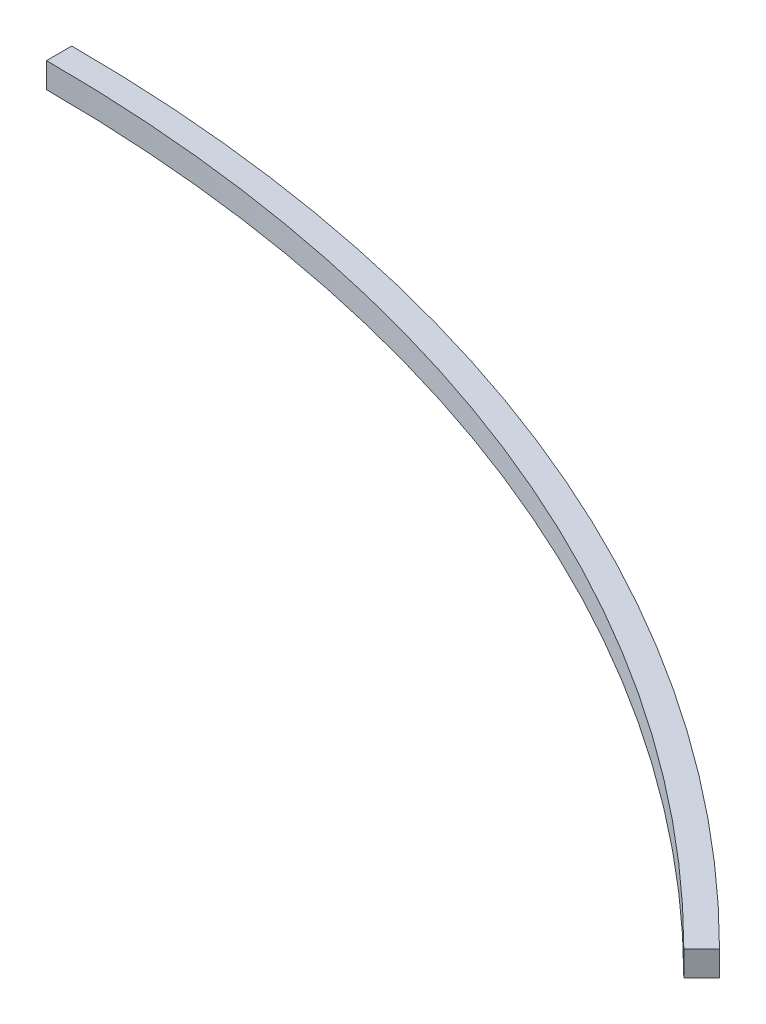
ISO-10303-21;
HEADER;
FILE_DESCRIPTION(('STEP AP214'),'2;1');
FILE_NAME('part.step','',(''),(''),'','','');
FILE_SCHEMA(('AUTOMOTIVE_DESIGN { 1 0 10303 214 1 1 1 1 }'));
ENDSEC;
DATA;
#1=APPLICATION_CONTEXT('core data for automotive mechanical design processes');
#2=APPLICATION_PROTOCOL_DEFINITION('international standard','automotive_design',2000,#1);
#3=PRODUCT_CONTEXT('',#1,'mechanical');
#4=PRODUCT('Part','Part','',(#3));
#5=PRODUCT_RELATED_PRODUCT_CATEGORY('part','',(#4));
#6=PRODUCT_DEFINITION_FORMATION('','',#4);
#7=PRODUCT_DEFINITION_CONTEXT('part definition',#1,'design');
#8=PRODUCT_DEFINITION('design','',#6,#7);
#9=PRODUCT_DEFINITION_SHAPE('','',#8);
#10=(LENGTH_UNIT() NAMED_UNIT(*) SI_UNIT(.MILLI.,.METRE.));
#11=(NAMED_UNIT(*) PLANE_ANGLE_UNIT() SI_UNIT($,.RADIAN.));
#12=(NAMED_UNIT(*) SI_UNIT($,.STERADIAN.) SOLID_ANGLE_UNIT());
#13=UNCERTAINTY_MEASURE_WITH_UNIT(LENGTH_MEASURE(1.E-05),#10,'distance_accuracy_value','');
#14=(GEOMETRIC_REPRESENTATION_CONTEXT(3) GLOBAL_UNCERTAINTY_ASSIGNED_CONTEXT((#13)) GLOBAL_UNIT_ASSIGNED_CONTEXT((#10,
#11,#12)) REPRESENTATION_CONTEXT('',''));
#15=CARTESIAN_POINT('',(0.,0.,0.));
#16=DIRECTION('',(0.,0.,1.));
#17=DIRECTION('',(1.,0.,0.));
#18=AXIS2_PLACEMENT_3D('',#15,#16,#17);
#19=CARTESIAN_POINT('',(0.,10.,0.));
#20=DIRECTION('',(0.,-1.,0.));
#21=DIRECTION('',(0.,0.,-1.));
#22=AXIS2_PLACEMENT_3D('',#19,#20,#21);
#23=CYLINDRICAL_SURFACE('',#22,620.);
#24=CARTESIAN_POINT('',(0.,0.,0.));
#25=DIRECTION('',(0.,1.,0.));
#26=DIRECTION('',(0.,0.,1.));
#27=AXIS2_PLACEMENT_3D('',#24,#25,#26);
#28=CIRCLE('',#27,620.);
#29=CARTESIAN_POINT('',(0.,0.,-620.));
#30=VERTEX_POINT('',#29);
#31=CARTESIAN_POINT('',(438.40620433566,0.,-438.406204335659));
#32=VERTEX_POINT('',#31);
#33=EDGE_CURVE('E97',#30,#32,#28,.F.);
#34=ORIENTED_EDGE('',*,*,#33,.F.);
#35=DIRECTION('',(0.,-1.,0.));
#36=VECTOR('',#35,1.);
#37=CARTESIAN_POINT('',(0.,10.,-620.));
#38=LINE('',#37,#36);
#39=CARTESIAN_POINT('',(0.,10.,-620.));
#40=VERTEX_POINT('',#39);
#41=EDGE_CURVE('E11',#40,#30,#38,.T.);
#42=ORIENTED_EDGE('',*,*,#41,.F.);
#43=CARTESIAN_POINT('',(0.,10.,0.));
#44=DIRECTION('',(0.,1.,0.));
#45=DIRECTION('',(0.,0.,1.));
#46=AXIS2_PLACEMENT_3D('',#43,#44,#45);
#47=CIRCLE('',#46,620.);
#48=CARTESIAN_POINT('',(438.40620433566,10.,-438.406204335659));
#49=VERTEX_POINT('',#48);
#50=EDGE_CURVE('E91',#40,#49,#47,.F.);
#51=ORIENTED_EDGE('',*,*,#50,.T.);
#52=DIRECTION('',(0.,-1.,0.));
#53=VECTOR('',#52,1.);
#54=CARTESIAN_POINT('',(438.40620433566,10.,-438.406204335659));
#55=LINE('',#54,#53);
#56=EDGE_CURVE('E72',#49,#32,#55,.T.);
#57=ORIENTED_EDGE('',*,*,#56,.T.);
#58=EDGE_LOOP('',(#34,#42,#51,#57));
#59=FACE_BOUND('',#58,.T.);
#60=ADVANCED_FACE('F34',(#59),#23,.T.);
#61=CARTESIAN_POINT('',(0.,10.,0.));
#62=DIRECTION('',(-1.,0.,0.));
#63=DIRECTION('',(0.,0.,1.));
#64=AXIS2_PLACEMENT_3D('',#61,#62,#63);
#65=PLANE('',#64);
#66=DIRECTION('',(0.,0.,-1.));
#67=VECTOR('',#66,1.);
#68=CARTESIAN_POINT('',(0.,0.,0.));
#69=LINE('',#68,#67);
#70=CARTESIAN_POINT('',(0.,0.,-610.));
#71=VERTEX_POINT('',#70);
#72=EDGE_CURVE('E85',#71,#30,#69,.T.);
#73=ORIENTED_EDGE('',*,*,#72,.F.);
#74=DIRECTION('',(0.,-1.,0.));
#75=VECTOR('',#74,1.);
#76=CARTESIAN_POINT('',(0.,10.,-610.));
#77=LINE('',#76,#75);
#78=CARTESIAN_POINT('',(0.,10.,-610.));
#79=VERTEX_POINT('',#78);
#80=EDGE_CURVE('E42',#79,#71,#77,.T.);
#81=ORIENTED_EDGE('',*,*,#80,.F.);
#82=DIRECTION('',(0.,0.,-1.));
#83=VECTOR('',#82,1.);
#84=CARTESIAN_POINT('',(0.,10.,0.));
#85=LINE('',#84,#83);
#86=EDGE_CURVE('E83',#79,#40,#85,.T.);
#87=ORIENTED_EDGE('',*,*,#86,.T.);
#88=ORIENTED_EDGE('',*,*,#41,.T.);
#89=EDGE_LOOP('',(#73,#81,#87,#88));
#90=FACE_BOUND('',#89,.T.);
#91=ADVANCED_FACE('F81',(#90),#65,.T.);
#92=CARTESIAN_POINT('',(0.,10.,0.));
#93=DIRECTION('',(0.,-1.,0.));
#94=DIRECTION('',(0.,0.,-1.));
#95=AXIS2_PLACEMENT_3D('',#92,#93,#94);
#96=CYLINDRICAL_SURFACE('',#95,610.);
#97=CARTESIAN_POINT('',(0.,0.,0.));
#98=DIRECTION('',(0.,1.,0.));
#99=DIRECTION('',(0.,0.,1.));
#100=AXIS2_PLACEMENT_3D('',#97,#98,#99);
#101=CIRCLE('',#100,610.);
#102=CARTESIAN_POINT('',(431.335136523795,0.,-431.335136523793));
#103=VERTEX_POINT('',#102);
#104=EDGE_CURVE('E65',#71,#103,#101,.F.);
#105=ORIENTED_EDGE('',*,*,#104,.T.);
#106=DIRECTION('',(0.,-1.,0.));
#107=VECTOR('',#106,1.);
#108=CARTESIAN_POINT('',(431.335136523795,10.,-431.335136523793));
#109=LINE('',#108,#107);
#110=CARTESIAN_POINT('',(431.335136523795,10.,-431.335136523793));
#111=VERTEX_POINT('',#110);
#112=EDGE_CURVE('E86',#111,#103,#109,.T.);
#113=ORIENTED_EDGE('',*,*,#112,.F.);
#114=CARTESIAN_POINT('',(0.,10.,0.));
#115=DIRECTION('',(0.,1.,0.));
#116=DIRECTION('',(0.,0.,1.));
#117=AXIS2_PLACEMENT_3D('',#114,#115,#116);
#118=CIRCLE('',#117,610.);
#119=EDGE_CURVE('E87',#79,#111,#118,.F.);
#120=ORIENTED_EDGE('',*,*,#119,.F.);
#121=ORIENTED_EDGE('',*,*,#80,.T.);
#122=EDGE_LOOP('',(#105,#113,#120,#121));
#123=FACE_BOUND('',#122,.T.);
#124=ADVANCED_FACE('F88',(#123),#96,.F.);
#125=CARTESIAN_POINT('',(7.06541606407699E-13,10.,7.06541606407699E-13));
#126=DIRECTION('',(-0.707106781186548,0.,-0.707106781186548));
#127=DIRECTION('',(-0.707106781186548,0.,0.707106781186548));
#128=AXIS2_PLACEMENT_3D('',#125,#126,#127);
#129=PLANE('',#128);
#130=DIRECTION('',(0.707106781186548,0.,-0.707106781186548));
#131=VECTOR('',#130,1.);
#132=CARTESIAN_POINT('',(7.06541606407699E-13,0.,7.06541606407699E-13));
#133=LINE('',#132,#131);
#134=EDGE_CURVE('E93',#103,#32,#133,.T.);
#135=ORIENTED_EDGE('',*,*,#134,.T.);
#136=ORIENTED_EDGE('',*,*,#56,.F.);
#137=DIRECTION('',(0.707106781186548,0.,-0.707106781186548));
#138=VECTOR('',#137,1.);
#139=CARTESIAN_POINT('',(7.06541606407699E-13,10.,7.06541606407699E-13));
#140=LINE('',#139,#138);
#141=EDGE_CURVE('E50',#111,#49,#140,.T.);
#142=ORIENTED_EDGE('',*,*,#141,.F.);
#143=ORIENTED_EDGE('',*,*,#112,.T.);
#144=EDGE_LOOP('',(#135,#136,#142,#143));
#145=FACE_BOUND('',#144,.T.);
#146=ADVANCED_FACE('F106',(#145),#129,.F.);
#147=CARTESIAN_POINT('',(0.,10.,0.));
#148=DIRECTION('',(0.,1.,0.));
#149=DIRECTION('',(0.,0.,1.));
#150=AXIS2_PLACEMENT_3D('',#147,#148,#149);
#151=PLANE('',#150);
#152=ORIENTED_EDGE('',*,*,#50,.F.);
#153=ORIENTED_EDGE('',*,*,#86,.F.);
#154=ORIENTED_EDGE('',*,*,#119,.T.);
#155=ORIENTED_EDGE('',*,*,#141,.T.);
#156=EDGE_LOOP('',(#152,#153,#154,#155));
#157=FACE_BOUND('',#156,.T.);
#158=ADVANCED_FACE('F90',(#157),#151,.T.);
#159=CARTESIAN_POINT('',(0.,0.,0.));
#160=DIRECTION('',(0.,1.,0.));
#161=DIRECTION('',(0.,0.,1.));
#162=AXIS2_PLACEMENT_3D('',#159,#160,#161);
#163=PLANE('',#162);
#164=ORIENTED_EDGE('',*,*,#33,.T.);
#165=ORIENTED_EDGE('',*,*,#134,.F.);
#166=ORIENTED_EDGE('',*,*,#104,.F.);
#167=ORIENTED_EDGE('',*,*,#72,.T.);
#168=EDGE_LOOP('',(#164,#165,#166,#167));
#169=FACE_BOUND('',#168,.T.);
#170=ADVANCED_FACE('F108',(#169),#163,.F.);
#171=CLOSED_SHELL('',(#60,#91,#124,#146,#158,#170));
#172=MANIFOLD_SOLID_BREP('B2',#171);
#173=ADVANCED_BREP_SHAPE_REPRESENTATION('',(#18,#172),#14);
#174=SHAPE_DEFINITION_REPRESENTATION(#9,#173);
ENDSEC;
END-ISO-10303-21;
